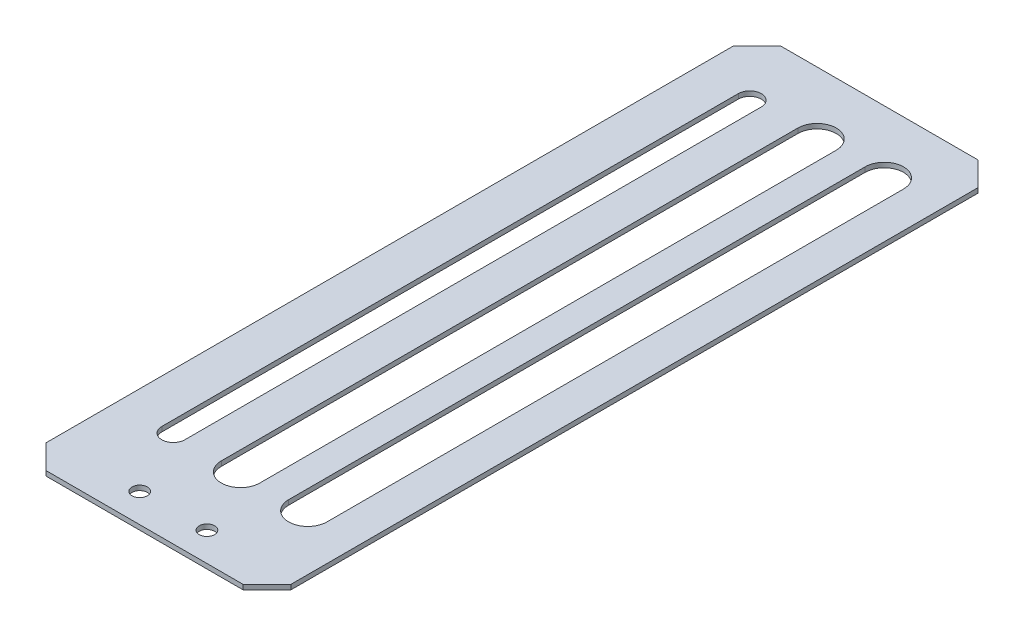
ISO-10303-21;
HEADER;
FILE_DESCRIPTION(('STEP AP214'),'2;1');
FILE_NAME('part.step','',(''),(''),'','','');
FILE_SCHEMA(('AUTOMOTIVE_DESIGN { 1 0 10303 214 1 1 1 1 }'));
ENDSEC;
DATA;
#1=APPLICATION_CONTEXT('core data for automotive mechanical design processes');
#2=APPLICATION_PROTOCOL_DEFINITION('international standard','automotive_design',2000,#1);
#3=PRODUCT_CONTEXT('',#1,'mechanical');
#4=PRODUCT('Part','Part','',(#3));
#5=PRODUCT_RELATED_PRODUCT_CATEGORY('part','',(#4));
#6=PRODUCT_DEFINITION_FORMATION('','',#4);
#7=PRODUCT_DEFINITION_CONTEXT('part definition',#1,'design');
#8=PRODUCT_DEFINITION('design','',#6,#7);
#9=PRODUCT_DEFINITION_SHAPE('','',#8);
#10=(LENGTH_UNIT() NAMED_UNIT(*) SI_UNIT(.MILLI.,.METRE.));
#11=(NAMED_UNIT(*) PLANE_ANGLE_UNIT() SI_UNIT($,.RADIAN.));
#12=(NAMED_UNIT(*) SI_UNIT($,.STERADIAN.) SOLID_ANGLE_UNIT());
#13=UNCERTAINTY_MEASURE_WITH_UNIT(LENGTH_MEASURE(1.E-05),#10,'distance_accuracy_value','');
#14=(GEOMETRIC_REPRESENTATION_CONTEXT(3) GLOBAL_UNCERTAINTY_ASSIGNED_CONTEXT((#13)) GLOBAL_UNIT_ASSIGNED_CONTEXT((#10,
#11,#12)) REPRESENTATION_CONTEXT('',''));
#15=CARTESIAN_POINT('',(0.,0.,0.));
#16=DIRECTION('',(0.,0.,1.));
#17=DIRECTION('',(1.,0.,0.));
#18=AXIS2_PLACEMENT_3D('',#15,#16,#17);
#19=CARTESIAN_POINT('',(-25.5,1.,-76.5));
#20=DIRECTION('',(1.,0.,0.));
#21=DIRECTION('',(0.,0.,-1.));
#22=AXIS2_PLACEMENT_3D('',#19,#20,#21);
#23=PLANE('',#22);
#24=DIRECTION('',(0.,0.,1.));
#25=VECTOR('',#24,1.);
#26=CARTESIAN_POINT('',(-25.5,1.,-76.5));
#27=LINE('',#26,#25);
#28=CARTESIAN_POINT('',(-25.5,1.,-71.5));
#29=VERTEX_POINT('',#28);
#30=CARTESIAN_POINT('',(-25.5,1.,71.5));
#31=VERTEX_POINT('',#30);
#32=EDGE_CURVE('E294',#29,#31,#27,.T.);
#33=ORIENTED_EDGE('',*,*,#32,.F.);
#34=DIRECTION('',(0.,-1.,0.));
#35=VECTOR('',#34,1.);
#36=CARTESIAN_POINT('',(-25.5,1.,-71.5));
#37=LINE('',#36,#35);
#38=CARTESIAN_POINT('',(-25.5,0.,-71.5));
#39=VERTEX_POINT('',#38);
#40=EDGE_CURVE('E316',#29,#39,#37,.T.);
#41=ORIENTED_EDGE('',*,*,#40,.T.);
#42=DIRECTION('',(0.,0.,1.));
#43=VECTOR('',#42,1.);
#44=CARTESIAN_POINT('',(-25.5,0.,-76.5));
#45=LINE('',#44,#43);
#46=CARTESIAN_POINT('',(-25.5,0.,71.5));
#47=VERTEX_POINT('',#46);
#48=EDGE_CURVE('E291',#39,#47,#45,.T.);
#49=ORIENTED_EDGE('',*,*,#48,.T.);
#50=DIRECTION('',(0.,1.,0.));
#51=VECTOR('',#50,1.);
#52=CARTESIAN_POINT('',(-25.5,1.,71.5));
#53=LINE('',#52,#51);
#54=EDGE_CURVE('E305',#47,#31,#53,.T.);
#55=ORIENTED_EDGE('',*,*,#54,.T.);
#56=EDGE_LOOP('',(#33,#41,#49,#55));
#57=FACE_BOUND('',#56,.T.);
#58=ADVANCED_FACE('F36',(#57),#23,.F.);
#59=CARTESIAN_POINT('',(25.5,1.,76.5));
#60=DIRECTION('',(0.,0.,-1.));
#61=DIRECTION('',(-1.,0.,0.));
#62=AXIS2_PLACEMENT_3D('',#59,#60,#61);
#63=PLANE('',#62);
#64=DIRECTION('',(1.,0.,0.));
#65=VECTOR('',#64,1.);
#66=CARTESIAN_POINT('',(25.5,0.,76.5));
#67=LINE('',#66,#65);
#68=CARTESIAN_POINT('',(-20.5,0.,76.5));
#69=VERTEX_POINT('',#68);
#70=CARTESIAN_POINT('',(20.5,0.,76.5));
#71=VERTEX_POINT('',#70);
#72=EDGE_CURVE('E308',#69,#71,#67,.T.);
#73=ORIENTED_EDGE('',*,*,#72,.T.);
#74=DIRECTION('',(0.,1.,0.));
#75=VECTOR('',#74,1.);
#76=CARTESIAN_POINT('',(20.5,1.,76.5));
#77=LINE('',#76,#75);
#78=CARTESIAN_POINT('',(20.5,1.,76.5));
#79=VERTEX_POINT('',#78);
#80=EDGE_CURVE('E11',#71,#79,#77,.T.);
#81=ORIENTED_EDGE('',*,*,#80,.T.);
#82=DIRECTION('',(1.,0.,0.));
#83=VECTOR('',#82,1.);
#84=CARTESIAN_POINT('',(25.5,1.,76.5));
#85=LINE('',#84,#83);
#86=CARTESIAN_POINT('',(-20.5,1.,76.5));
#87=VERTEX_POINT('',#86);
#88=EDGE_CURVE('E297',#87,#79,#85,.T.);
#89=ORIENTED_EDGE('',*,*,#88,.F.);
#90=DIRECTION('',(0.,-1.,0.));
#91=VECTOR('',#90,1.);
#92=CARTESIAN_POINT('',(-20.5,1.,76.5));
#93=LINE('',#92,#91);
#94=EDGE_CURVE('E45',#87,#69,#93,.T.);
#95=ORIENTED_EDGE('',*,*,#94,.T.);
#96=EDGE_LOOP('',(#73,#81,#89,#95));
#97=FACE_BOUND('',#96,.T.);
#98=ADVANCED_FACE('F347',(#97),#63,.F.);
#99=CARTESIAN_POINT('',(25.5,1.,-76.5));
#100=DIRECTION('',(-1.,0.,0.));
#101=DIRECTION('',(0.,0.,1.));
#102=AXIS2_PLACEMENT_3D('',#99,#100,#101);
#103=PLANE('',#102);
#104=DIRECTION('',(0.,0.,-1.));
#105=VECTOR('',#104,1.);
#106=CARTESIAN_POINT('',(25.5,0.,-76.5));
#107=LINE('',#106,#105);
#108=CARTESIAN_POINT('',(25.5,0.,71.5));
#109=VERTEX_POINT('',#108);
#110=CARTESIAN_POINT('',(25.5,0.,-71.5));
#111=VERTEX_POINT('',#110);
#112=EDGE_CURVE('E311',#109,#111,#107,.T.);
#113=ORIENTED_EDGE('',*,*,#112,.T.);
#114=DIRECTION('',(0.,1.,0.));
#115=VECTOR('',#114,1.);
#116=CARTESIAN_POINT('',(25.5,1.,-71.5));
#117=LINE('',#116,#115);
#118=CARTESIAN_POINT('',(25.5,1.,-71.5));
#119=VERTEX_POINT('',#118);
#120=EDGE_CURVE('E52',#111,#119,#117,.T.);
#121=ORIENTED_EDGE('',*,*,#120,.T.);
#122=DIRECTION('',(0.,0.,-1.));
#123=VECTOR('',#122,1.);
#124=CARTESIAN_POINT('',(25.5,1.,-76.5));
#125=LINE('',#124,#123);
#126=CARTESIAN_POINT('',(25.5,1.,71.5));
#127=VERTEX_POINT('',#126);
#128=EDGE_CURVE('E300',#127,#119,#125,.T.);
#129=ORIENTED_EDGE('',*,*,#128,.F.);
#130=DIRECTION('',(0.,-1.,0.));
#131=VECTOR('',#130,1.);
#132=CARTESIAN_POINT('',(25.5,1.,71.5));
#133=LINE('',#132,#131);
#134=EDGE_CURVE('E339',#127,#109,#133,.T.);
#135=ORIENTED_EDGE('',*,*,#134,.T.);
#136=EDGE_LOOP('',(#113,#121,#129,#135));
#137=FACE_BOUND('',#136,.T.);
#138=ADVANCED_FACE('F357',(#137),#103,.F.);
#139=CARTESIAN_POINT('',(25.5,1.,-76.5));
#140=DIRECTION('',(0.,0.,1.));
#141=DIRECTION('',(1.,0.,0.));
#142=AXIS2_PLACEMENT_3D('',#139,#140,#141);
#143=PLANE('',#142);
#144=DIRECTION('',(-1.,0.,0.));
#145=VECTOR('',#144,1.);
#146=CARTESIAN_POINT('',(25.5,0.,-76.5));
#147=LINE('',#146,#145);
#148=CARTESIAN_POINT('',(20.5,0.,-76.5));
#149=VERTEX_POINT('',#148);
#150=CARTESIAN_POINT('',(-20.5,0.,-76.5));
#151=VERTEX_POINT('',#150);
#152=EDGE_CURVE('E298',#149,#151,#147,.T.);
#153=ORIENTED_EDGE('',*,*,#152,.T.);
#154=DIRECTION('',(0.,1.,0.));
#155=VECTOR('',#154,1.);
#156=CARTESIAN_POINT('',(-20.5,1.,-76.5));
#157=LINE('',#156,#155);
#158=CARTESIAN_POINT('',(-20.5,1.,-76.5));
#159=VERTEX_POINT('',#158);
#160=EDGE_CURVE('E330',#151,#159,#157,.T.);
#161=ORIENTED_EDGE('',*,*,#160,.T.);
#162=DIRECTION('',(-1.,0.,0.));
#163=VECTOR('',#162,1.);
#164=CARTESIAN_POINT('',(25.5,1.,-76.5));
#165=LINE('',#164,#163);
#166=CARTESIAN_POINT('',(20.5,1.,-76.5));
#167=VERTEX_POINT('',#166);
#168=EDGE_CURVE('E302',#167,#159,#165,.T.);
#169=ORIENTED_EDGE('',*,*,#168,.F.);
#170=DIRECTION('',(0.,-1.,0.));
#171=VECTOR('',#170,1.);
#172=CARTESIAN_POINT('',(20.5,1.,-76.5));
#173=LINE('',#172,#171);
#174=EDGE_CURVE('E327',#167,#149,#173,.T.);
#175=ORIENTED_EDGE('',*,*,#174,.T.);
#176=EDGE_LOOP('',(#153,#161,#169,#175));
#177=FACE_BOUND('',#176,.T.);
#178=ADVANCED_FACE('F367',(#177),#143,.F.);
#179=CARTESIAN_POINT('',(0.,1.,0.));
#180=DIRECTION('',(0.,-1.,0.));
#181=DIRECTION('',(0.,0.,-1.));
#182=AXIS2_PLACEMENT_3D('',#179,#180,#181);
#183=PLANE('',#182);
#184=CARTESIAN_POINT('',(7.,1.,70.5));
#185=DIRECTION('',(0.,1.,0.));
#186=DIRECTION('',(0.,0.,1.));
#187=AXIS2_PLACEMENT_3D('',#184,#185,#186);
#188=CIRCLE('',#187,1.6);
#189=CARTESIAN_POINT('',(7.,1.,72.1));
#190=VERTEX_POINT('',#189);
#191=EDGE_CURVE('E245',#190,#190,#188,.T.);
#192=ORIENTED_EDGE('',*,*,#191,.F.);
#193=EDGE_LOOP('',(#192));
#194=FACE_BOUND('',#193,.T.);
#195=DIRECTION('',(0.,0.,1.));
#196=VECTOR('',#195,1.);
#197=CARTESIAN_POINT('',(-3.99999999999999,1.,-63.5));
#198=LINE('',#197,#196);
#199=CARTESIAN_POINT('',(-3.99999999999999,1.,-63.5));
#200=VERTEX_POINT('',#199);
#201=CARTESIAN_POINT('',(-4.00000000000001,1.,56.5));
#202=VERTEX_POINT('',#201);
#203=EDGE_CURVE('E234',#200,#202,#198,.T.);
#204=ORIENTED_EDGE('',*,*,#203,.F.);
#205=CARTESIAN_POINT('',(0.,1.,-63.5));
#206=DIRECTION('',(0.,1.,0.));
#207=DIRECTION('',(0.,0.,1.));
#208=AXIS2_PLACEMENT_3D('',#205,#206,#207);
#209=CIRCLE('',#208,3.99999999999999);
#210=CARTESIAN_POINT('',(3.99999999999999,1.,-63.5));
#211=VERTEX_POINT('',#210);
#212=EDGE_CURVE('E232',#211,#200,#209,.T.);
#213=ORIENTED_EDGE('',*,*,#212,.F.);
#214=DIRECTION('',(0.,0.,-1.));
#215=VECTOR('',#214,1.);
#216=CARTESIAN_POINT('',(3.99999999999999,1.,-63.5));
#217=LINE('',#216,#215);
#218=CARTESIAN_POINT('',(4.00000000000002,1.,56.5));
#219=VERTEX_POINT('',#218);
#220=EDGE_CURVE('E222',#219,#211,#217,.T.);
#221=ORIENTED_EDGE('',*,*,#220,.F.);
#222=CARTESIAN_POINT('',(0.,1.,56.5));
#223=DIRECTION('',(0.,1.,0.));
#224=DIRECTION('',(0.,0.,1.));
#225=AXIS2_PLACEMENT_3D('',#222,#223,#224);
#226=CIRCLE('',#225,4.00000000000001);
#227=EDGE_CURVE('E238',#202,#219,#226,.T.);
#228=ORIENTED_EDGE('',*,*,#227,.F.);
#229=EDGE_LOOP('',(#204,#213,#221,#228));
#230=FACE_BOUND('',#229,.T.);
#231=DIRECTION('',(0.,0.,1.));
#232=VECTOR('',#231,1.);
#233=CARTESIAN_POINT('',(10.,1.,-63.5));
#234=LINE('',#233,#232);
#235=CARTESIAN_POINT('',(10.,1.,-63.5));
#236=VERTEX_POINT('',#235);
#237=CARTESIAN_POINT('',(10.,1.,56.5));
#238=VERTEX_POINT('',#237);
#239=EDGE_CURVE('E267',#236,#238,#234,.T.);
#240=ORIENTED_EDGE('',*,*,#239,.F.);
#241=CARTESIAN_POINT('',(14.,1.,-63.5));
#242=DIRECTION('',(0.,1.,0.));
#243=DIRECTION('',(0.,0.,1.));
#244=AXIS2_PLACEMENT_3D('',#241,#242,#243);
#245=CIRCLE('',#244,4.);
#246=CARTESIAN_POINT('',(18.,1.,-63.5));
#247=VERTEX_POINT('',#246);
#248=EDGE_CURVE('E214',#247,#236,#245,.T.);
#249=ORIENTED_EDGE('',*,*,#248,.F.);
#250=DIRECTION('',(0.,0.,-1.));
#251=VECTOR('',#250,1.);
#252=CARTESIAN_POINT('',(18.,1.,-63.5));
#253=LINE('',#252,#251);
#254=CARTESIAN_POINT('',(18.,1.,56.5));
#255=VERTEX_POINT('',#254);
#256=EDGE_CURVE('E256',#255,#247,#253,.T.);
#257=ORIENTED_EDGE('',*,*,#256,.F.);
#258=CARTESIAN_POINT('',(14.,1.,56.5));
#259=DIRECTION('',(0.,1.,0.));
#260=DIRECTION('',(0.,0.,1.));
#261=AXIS2_PLACEMENT_3D('',#258,#259,#260);
#262=CIRCLE('',#261,4.);
#263=EDGE_CURVE('E270',#238,#255,#262,.T.);
#264=ORIENTED_EDGE('',*,*,#263,.F.);
#265=EDGE_LOOP('',(#240,#249,#257,#264));
#266=FACE_BOUND('',#265,.T.);
#267=CARTESIAN_POINT('',(-7.,1.,70.5));
#268=DIRECTION('',(0.,1.,0.));
#269=DIRECTION('',(0.,0.,1.));
#270=AXIS2_PLACEMENT_3D('',#267,#268,#269);
#271=CIRCLE('',#270,1.60000000000001);
#272=CARTESIAN_POINT('',(-7.,1.,72.1));
#273=VERTEX_POINT('',#272);
#274=EDGE_CURVE('E285',#273,#273,#271,.T.);
#275=ORIENTED_EDGE('',*,*,#274,.F.);
#276=EDGE_LOOP('',(#275));
#277=FACE_BOUND('',#276,.T.);
#278=ORIENTED_EDGE('',*,*,#168,.T.);
#279=DIRECTION('',(0.707106781186549,0.,-0.707106781186546));
#280=VECTOR('',#279,1.);
#281=CARTESIAN_POINT('',(-25.5,1.,-71.5));
#282=LINE('',#281,#280);
#283=EDGE_CURVE('E337',#159,#29,#282,.F.);
#284=ORIENTED_EDGE('',*,*,#283,.T.);
#285=ORIENTED_EDGE('',*,*,#32,.T.);
#286=DIRECTION('',(-0.707106781186547,0.,-0.707106781186548));
#287=VECTOR('',#286,1.);
#288=CARTESIAN_POINT('',(-20.5,1.,76.5));
#289=LINE('',#288,#287);
#290=EDGE_CURVE('E332',#31,#87,#289,.F.);
#291=ORIENTED_EDGE('',*,*,#290,.T.);
#292=ORIENTED_EDGE('',*,*,#88,.T.);
#293=DIRECTION('',(-0.707106781186549,0.,0.707106781186546));
#294=VECTOR('',#293,1.);
#295=CARTESIAN_POINT('',(25.5,1.,71.5));
#296=LINE('',#295,#294);
#297=EDGE_CURVE('E59',#79,#127,#296,.F.);
#298=ORIENTED_EDGE('',*,*,#297,.T.);
#299=ORIENTED_EDGE('',*,*,#128,.T.);
#300=DIRECTION('',(0.707106781186547,0.,0.707106781186549));
#301=VECTOR('',#300,1.);
#302=CARTESIAN_POINT('',(20.5,1.,-76.5));
#303=LINE('',#302,#301);
#304=EDGE_CURVE('E335',#119,#167,#303,.F.);
#305=ORIENTED_EDGE('',*,*,#304,.T.);
#306=EDGE_LOOP('',(#278,#284,#285,#291,#292,#298,#299,#305));
#307=FACE_BOUND('',#306,.T.);
#308=CARTESIAN_POINT('',(-14.,1.,-63.5));
#309=DIRECTION('',(0.,1.,0.));
#310=DIRECTION('',(0.,0.,1.));
#311=AXIS2_PLACEMENT_3D('',#308,#309,#310);
#312=CIRCLE('',#311,2.4);
#313=CARTESIAN_POINT('',(-11.6,1.,-63.5));
#314=VERTEX_POINT('',#313);
#315=CARTESIAN_POINT('',(-16.4,1.,-63.5));
#316=VERTEX_POINT('',#315);
#317=EDGE_CURVE('E182',#314,#316,#312,.T.);
#318=ORIENTED_EDGE('',*,*,#317,.F.);
#319=DIRECTION('',(0.,0.,-1.));
#320=VECTOR('',#319,1.);
#321=CARTESIAN_POINT('',(-11.6,1.,-63.5));
#322=LINE('',#321,#320);
#323=CARTESIAN_POINT('',(-11.6,1.,56.5));
#324=VERTEX_POINT('',#323);
#325=EDGE_CURVE('E199',#324,#314,#322,.T.);
#326=ORIENTED_EDGE('',*,*,#325,.F.);
#327=CARTESIAN_POINT('',(-14.,1.,56.5));
#328=DIRECTION('',(0.,1.,0.));
#329=DIRECTION('',(0.,0.,1.));
#330=AXIS2_PLACEMENT_3D('',#327,#328,#329);
#331=CIRCLE('',#330,2.4);
#332=CARTESIAN_POINT('',(-16.4,1.,56.5));
#333=VERTEX_POINT('',#332);
#334=EDGE_CURVE('E202',#333,#324,#331,.T.);
#335=ORIENTED_EDGE('',*,*,#334,.F.);
#336=DIRECTION('',(0.,0.,1.));
#337=VECTOR('',#336,1.);
#338=CARTESIAN_POINT('',(-16.4,1.,-63.5));
#339=LINE('',#338,#337);
#340=EDGE_CURVE('E208',#316,#333,#339,.T.);
#341=ORIENTED_EDGE('',*,*,#340,.F.);
#342=EDGE_LOOP('',(#318,#326,#335,#341));
#343=FACE_BOUND('',#342,.T.);
#344=ADVANCED_FACE('F359',(#194,#230,#266,#277,#307,#343),#183,.F.);
#345=CARTESIAN_POINT('',(0.,0.,0.));
#346=DIRECTION('',(0.,-1.,0.));
#347=DIRECTION('',(0.,0.,-1.));
#348=AXIS2_PLACEMENT_3D('',#345,#346,#347);
#349=PLANE('',#348);
#350=CARTESIAN_POINT('',(7.,0.,70.5));
#351=DIRECTION('',(0.,1.,0.));
#352=DIRECTION('',(0.,0.,1.));
#353=AXIS2_PLACEMENT_3D('',#350,#351,#352);
#354=CIRCLE('',#353,1.6);
#355=CARTESIAN_POINT('',(7.,0.,72.1));
#356=VERTEX_POINT('',#355);
#357=EDGE_CURVE('E282',#356,#356,#354,.T.);
#358=ORIENTED_EDGE('',*,*,#357,.T.);
#359=EDGE_LOOP('',(#358));
#360=FACE_BOUND('',#359,.T.);
#361=CARTESIAN_POINT('',(0.,0.,-63.5));
#362=DIRECTION('',(0.,1.,0.));
#363=DIRECTION('',(0.,0.,1.));
#364=AXIS2_PLACEMENT_3D('',#361,#362,#363);
#365=CIRCLE('',#364,3.99999999999999);
#366=CARTESIAN_POINT('',(3.99999999999999,0.,-63.5));
#367=VERTEX_POINT('',#366);
#368=CARTESIAN_POINT('',(-3.99999999999999,0.,-63.5));
#369=VERTEX_POINT('',#368);
#370=EDGE_CURVE('E218',#367,#369,#365,.T.);
#371=ORIENTED_EDGE('',*,*,#370,.T.);
#372=DIRECTION('',(0.,0.,1.));
#373=VECTOR('',#372,1.);
#374=CARTESIAN_POINT('',(-3.99999999999999,0.,-63.5));
#375=LINE('',#374,#373);
#376=CARTESIAN_POINT('',(-4.,0.,56.5));
#377=VERTEX_POINT('',#376);
#378=EDGE_CURVE('E221',#369,#377,#375,.T.);
#379=ORIENTED_EDGE('',*,*,#378,.T.);
#380=CARTESIAN_POINT('',(0.,0.,56.5));
#381=DIRECTION('',(0.,1.,0.));
#382=DIRECTION('',(0.,0.,1.));
#383=AXIS2_PLACEMENT_3D('',#380,#381,#382);
#384=CIRCLE('',#383,4.00000000000001);
#385=CARTESIAN_POINT('',(4.00000000000002,0.,56.5));
#386=VERTEX_POINT('',#385);
#387=EDGE_CURVE('E225',#377,#386,#384,.T.);
#388=ORIENTED_EDGE('',*,*,#387,.T.);
#389=DIRECTION('',(0.,0.,-1.));
#390=VECTOR('',#389,1.);
#391=CARTESIAN_POINT('',(3.99999999999999,0.,-63.5));
#392=LINE('',#391,#390);
#393=EDGE_CURVE('E228',#386,#367,#392,.T.);
#394=ORIENTED_EDGE('',*,*,#393,.T.);
#395=EDGE_LOOP('',(#371,#379,#388,#394));
#396=FACE_BOUND('',#395,.T.);
#397=CARTESIAN_POINT('',(14.,0.,-63.5));
#398=DIRECTION('',(0.,1.,0.));
#399=DIRECTION('',(0.,0.,1.));
#400=AXIS2_PLACEMENT_3D('',#397,#398,#399);
#401=CIRCLE('',#400,4.);
#402=CARTESIAN_POINT('',(18.,0.,-63.5));
#403=VERTEX_POINT('',#402);
#404=CARTESIAN_POINT('',(10.,0.,-63.5));
#405=VERTEX_POINT('',#404);
#406=EDGE_CURVE('E252',#403,#405,#401,.T.);
#407=ORIENTED_EDGE('',*,*,#406,.T.);
#408=DIRECTION('',(0.,0.,1.));
#409=VECTOR('',#408,1.);
#410=CARTESIAN_POINT('',(10.,0.,-63.5));
#411=LINE('',#410,#409);
#412=CARTESIAN_POINT('',(10.,0.,56.5));
#413=VERTEX_POINT('',#412);
#414=EDGE_CURVE('E255',#405,#413,#411,.T.);
#415=ORIENTED_EDGE('',*,*,#414,.T.);
#416=CARTESIAN_POINT('',(14.,0.,56.5));
#417=DIRECTION('',(0.,1.,0.));
#418=DIRECTION('',(0.,0.,1.));
#419=AXIS2_PLACEMENT_3D('',#416,#417,#418);
#420=CIRCLE('',#419,4.);
#421=CARTESIAN_POINT('',(18.,0.,56.5));
#422=VERTEX_POINT('',#421);
#423=EDGE_CURVE('E259',#413,#422,#420,.T.);
#424=ORIENTED_EDGE('',*,*,#423,.T.);
#425=DIRECTION('',(0.,0.,-1.));
#426=VECTOR('',#425,1.);
#427=CARTESIAN_POINT('',(18.,0.,-63.5));
#428=LINE('',#427,#426);
#429=EDGE_CURVE('E262',#422,#403,#428,.T.);
#430=ORIENTED_EDGE('',*,*,#429,.T.);
#431=EDGE_LOOP('',(#407,#415,#424,#430));
#432=FACE_BOUND('',#431,.T.);
#433=CARTESIAN_POINT('',(-7.,0.,70.5));
#434=DIRECTION('',(0.,1.,0.));
#435=DIRECTION('',(0.,0.,1.));
#436=AXIS2_PLACEMENT_3D('',#433,#434,#435);
#437=CIRCLE('',#436,1.60000000000001);
#438=CARTESIAN_POINT('',(-7.,0.,72.1));
#439=VERTEX_POINT('',#438);
#440=EDGE_CURVE('E288',#439,#439,#437,.T.);
#441=ORIENTED_EDGE('',*,*,#440,.T.);
#442=EDGE_LOOP('',(#441));
#443=FACE_BOUND('',#442,.T.);
#444=ORIENTED_EDGE('',*,*,#48,.F.);
#445=DIRECTION('',(-0.707106781186549,0.,0.707106781186546));
#446=VECTOR('',#445,1.);
#447=CARTESIAN_POINT('',(-48.5,0.,-48.5000000000001));
#448=LINE('',#447,#446);
#449=EDGE_CURVE('E325',#39,#151,#448,.F.);
#450=ORIENTED_EDGE('',*,*,#449,.T.);
#451=ORIENTED_EDGE('',*,*,#152,.F.);
#452=DIRECTION('',(-0.707106781186547,0.,-0.707106781186549));
#453=VECTOR('',#452,1.);
#454=CARTESIAN_POINT('',(48.5,0.,-48.4999999999999));
#455=LINE('',#454,#453);
#456=EDGE_CURVE('E323',#149,#111,#455,.F.);
#457=ORIENTED_EDGE('',*,*,#456,.T.);
#458=ORIENTED_EDGE('',*,*,#112,.F.);
#459=DIRECTION('',(0.707106781186549,0.,-0.707106781186546));
#460=VECTOR('',#459,1.);
#461=CARTESIAN_POINT('',(48.4999999999999,0.,48.5000000000002));
#462=LINE('',#461,#460);
#463=EDGE_CURVE('E321',#109,#71,#462,.F.);
#464=ORIENTED_EDGE('',*,*,#463,.T.);
#465=ORIENTED_EDGE('',*,*,#72,.F.);
#466=DIRECTION('',(0.707106781186547,0.,0.707106781186548));
#467=VECTOR('',#466,1.);
#468=CARTESIAN_POINT('',(-48.5,0.,48.5));
#469=LINE('',#468,#467);
#470=EDGE_CURVE('E319',#69,#47,#469,.F.);
#471=ORIENTED_EDGE('',*,*,#470,.T.);
#472=EDGE_LOOP('',(#444,#450,#451,#457,#458,#464,#465,#471));
#473=FACE_BOUND('',#472,.T.);
#474=DIRECTION('',(0.,0.,-1.));
#475=VECTOR('',#474,1.);
#476=CARTESIAN_POINT('',(-11.6,0.,-63.5));
#477=LINE('',#476,#475);
#478=CARTESIAN_POINT('',(-11.6,0.,56.5));
#479=VERTEX_POINT('',#478);
#480=CARTESIAN_POINT('',(-11.6,0.,-63.5));
#481=VERTEX_POINT('',#480);
#482=EDGE_CURVE('E187',#479,#481,#477,.T.);
#483=ORIENTED_EDGE('',*,*,#482,.T.);
#484=CARTESIAN_POINT('',(-14.,0.,-63.5));
#485=DIRECTION('',(0.,1.,0.));
#486=DIRECTION('',(0.,0.,1.));
#487=AXIS2_PLACEMENT_3D('',#484,#485,#486);
#488=CIRCLE('',#487,2.4);
#489=CARTESIAN_POINT('',(-16.4,0.,-63.5));
#490=VERTEX_POINT('',#489);
#491=EDGE_CURVE('E179',#481,#490,#488,.T.);
#492=ORIENTED_EDGE('',*,*,#491,.T.);
#493=DIRECTION('',(0.,0.,1.));
#494=VECTOR('',#493,1.);
#495=CARTESIAN_POINT('',(-16.4,0.,-63.5));
#496=LINE('',#495,#494);
#497=CARTESIAN_POINT('',(-16.4,0.,56.5));
#498=VERTEX_POINT('',#497);
#499=EDGE_CURVE('E191',#490,#498,#496,.T.);
#500=ORIENTED_EDGE('',*,*,#499,.T.);
#501=CARTESIAN_POINT('',(-14.,0.,56.5));
#502=DIRECTION('',(0.,1.,0.));
#503=DIRECTION('',(0.,0.,1.));
#504=AXIS2_PLACEMENT_3D('',#501,#502,#503);
#505=CIRCLE('',#504,2.4);
#506=EDGE_CURVE('E195',#498,#479,#505,.T.);
#507=ORIENTED_EDGE('',*,*,#506,.T.);
#508=EDGE_LOOP('',(#483,#492,#500,#507));
#509=FACE_BOUND('',#508,.T.);
#510=ADVANCED_FACE('F197',(#360,#396,#432,#443,#473,#509),#349,.T.);
#511=CARTESIAN_POINT('',(-7.,0.,70.5));
#512=DIRECTION('',(0.,1.,0.));
#513=DIRECTION('',(0.,0.,1.));
#514=AXIS2_PLACEMENT_3D('',#511,#512,#513);
#515=CYLINDRICAL_SURFACE('',#514,1.60000000000001);
#516=ORIENTED_EDGE('',*,*,#440,.F.);
#517=EDGE_LOOP('',(#516));
#518=FACE_BOUND('',#517,.T.);
#519=ORIENTED_EDGE('',*,*,#274,.T.);
#520=EDGE_LOOP('',(#519));
#521=FACE_BOUND('',#520,.T.);
#522=ADVANCED_FACE('F439',(#518,#521),#515,.F.);
#523=CARTESIAN_POINT('',(14.,0.,-63.5));
#524=DIRECTION('',(0.,1.,0.));
#525=DIRECTION('',(0.,0.,1.));
#526=AXIS2_PLACEMENT_3D('',#523,#524,#525);
#527=CYLINDRICAL_SURFACE('',#526,4.);
#528=ORIENTED_EDGE('',*,*,#248,.T.);
#529=DIRECTION('',(0.,1.,0.));
#530=VECTOR('',#529,1.);
#531=CARTESIAN_POINT('',(10.,0.,-63.5));
#532=LINE('',#531,#530);
#533=EDGE_CURVE('E265',#405,#236,#532,.T.);
#534=ORIENTED_EDGE('',*,*,#533,.F.);
#535=ORIENTED_EDGE('',*,*,#406,.F.);
#536=DIRECTION('',(0.,1.,0.));
#537=VECTOR('',#536,1.);
#538=CARTESIAN_POINT('',(18.,0.,-63.5));
#539=LINE('',#538,#537);
#540=EDGE_CURVE('E235',#403,#247,#539,.T.);
#541=ORIENTED_EDGE('',*,*,#540,.T.);
#542=EDGE_LOOP('',(#528,#534,#535,#541));
#543=FACE_BOUND('',#542,.T.);
#544=ADVANCED_FACE('F501',(#543),#527,.F.);
#545=CARTESIAN_POINT('',(18.,0.,-63.5));
#546=DIRECTION('',(1.,0.,0.));
#547=DIRECTION('',(0.,0.,-1.));
#548=AXIS2_PLACEMENT_3D('',#545,#546,#547);
#549=PLANE('',#548);
#550=ORIENTED_EDGE('',*,*,#256,.T.);
#551=ORIENTED_EDGE('',*,*,#540,.F.);
#552=ORIENTED_EDGE('',*,*,#429,.F.);
#553=DIRECTION('',(0.,1.,0.));
#554=VECTOR('',#553,1.);
#555=CARTESIAN_POINT('',(18.,0.,56.5));
#556=LINE('',#555,#554);
#557=EDGE_CURVE('E276',#422,#255,#556,.T.);
#558=ORIENTED_EDGE('',*,*,#557,.T.);
#559=EDGE_LOOP('',(#550,#551,#552,#558));
#560=FACE_BOUND('',#559,.T.);
#561=ADVANCED_FACE('F497',(#560),#549,.F.);
#562=CARTESIAN_POINT('',(14.,0.,56.5));
#563=DIRECTION('',(0.,1.,0.));
#564=DIRECTION('',(0.,0.,1.));
#565=AXIS2_PLACEMENT_3D('',#562,#563,#564);
#566=CYLINDRICAL_SURFACE('',#565,4.);
#567=ORIENTED_EDGE('',*,*,#263,.T.);
#568=ORIENTED_EDGE('',*,*,#557,.F.);
#569=ORIENTED_EDGE('',*,*,#423,.F.);
#570=DIRECTION('',(0.,1.,0.));
#571=VECTOR('',#570,1.);
#572=CARTESIAN_POINT('',(10.,0.,56.5));
#573=LINE('',#572,#571);
#574=EDGE_CURVE('E278',#413,#238,#573,.T.);
#575=ORIENTED_EDGE('',*,*,#574,.T.);
#576=EDGE_LOOP('',(#567,#568,#569,#575));
#577=FACE_BOUND('',#576,.T.);
#578=ADVANCED_FACE('F500',(#577),#566,.F.);
#579=CARTESIAN_POINT('',(10.,0.,-63.5));
#580=DIRECTION('',(-1.,0.,0.));
#581=DIRECTION('',(0.,0.,1.));
#582=AXIS2_PLACEMENT_3D('',#579,#580,#581);
#583=PLANE('',#582);
#584=ORIENTED_EDGE('',*,*,#239,.T.);
#585=ORIENTED_EDGE('',*,*,#574,.F.);
#586=ORIENTED_EDGE('',*,*,#414,.F.);
#587=ORIENTED_EDGE('',*,*,#533,.T.);
#588=EDGE_LOOP('',(#584,#585,#586,#587));
#589=FACE_BOUND('',#588,.T.);
#590=ADVANCED_FACE('F495',(#589),#583,.F.);
#591=CARTESIAN_POINT('',(0.,0.,-63.5));
#592=DIRECTION('',(0.,1.,0.));
#593=DIRECTION('',(0.,0.,1.));
#594=AXIS2_PLACEMENT_3D('',#591,#592,#593);
#595=CYLINDRICAL_SURFACE('',#594,3.99999999999999);
#596=ORIENTED_EDGE('',*,*,#212,.T.);
#597=DIRECTION('',(0.,1.,0.));
#598=VECTOR('',#597,1.);
#599=CARTESIAN_POINT('',(-3.99999999999999,0.,-63.5));
#600=LINE('',#599,#598);
#601=EDGE_CURVE('E231',#369,#200,#600,.T.);
#602=ORIENTED_EDGE('',*,*,#601,.F.);
#603=ORIENTED_EDGE('',*,*,#370,.F.);
#604=DIRECTION('',(0.,1.,0.));
#605=VECTOR('',#604,1.);
#606=CARTESIAN_POINT('',(3.99999999999999,0.,-63.5));
#607=LINE('',#606,#605);
#608=EDGE_CURVE('E243',#367,#211,#607,.T.);
#609=ORIENTED_EDGE('',*,*,#608,.T.);
#610=EDGE_LOOP('',(#596,#602,#603,#609));
#611=FACE_BOUND('',#610,.T.);
#612=ADVANCED_FACE('F484',(#611),#595,.F.);
#613=CARTESIAN_POINT('',(3.99999999999999,0.,-63.5));
#614=DIRECTION('',(1.,0.,0.));
#615=DIRECTION('',(0.,0.,-1.));
#616=AXIS2_PLACEMENT_3D('',#613,#614,#615);
#617=PLANE('',#616);
#618=ORIENTED_EDGE('',*,*,#220,.T.);
#619=ORIENTED_EDGE('',*,*,#608,.F.);
#620=ORIENTED_EDGE('',*,*,#393,.F.);
#621=DIRECTION('',(0.,1.,0.));
#622=VECTOR('',#621,1.);
#623=CARTESIAN_POINT('',(4.00000000000002,0.,56.5));
#624=LINE('',#623,#622);
#625=EDGE_CURVE('E246',#386,#219,#624,.T.);
#626=ORIENTED_EDGE('',*,*,#625,.T.);
#627=EDGE_LOOP('',(#618,#619,#620,#626));
#628=FACE_BOUND('',#627,.T.);
#629=ADVANCED_FACE('F480',(#628),#617,.F.);
#630=CARTESIAN_POINT('',(0.,0.,56.5));
#631=DIRECTION('',(0.,1.,0.));
#632=DIRECTION('',(0.,0.,1.));
#633=AXIS2_PLACEMENT_3D('',#630,#631,#632);
#634=CYLINDRICAL_SURFACE('',#633,4.00000000000001);
#635=ORIENTED_EDGE('',*,*,#227,.T.);
#636=ORIENTED_EDGE('',*,*,#625,.F.);
#637=ORIENTED_EDGE('',*,*,#387,.F.);
#638=DIRECTION('',(0.,1.,0.));
#639=VECTOR('',#638,1.);
#640=CARTESIAN_POINT('',(-4.00000000000001,0.,56.5));
#641=LINE('',#640,#639);
#642=EDGE_CURVE('E248',#377,#202,#641,.T.);
#643=ORIENTED_EDGE('',*,*,#642,.T.);
#644=EDGE_LOOP('',(#635,#636,#637,#643));
#645=FACE_BOUND('',#644,.T.);
#646=ADVANCED_FACE('F483',(#645),#634,.F.);
#647=CARTESIAN_POINT('',(-3.99999999999999,0.,-63.5));
#648=DIRECTION('',(-1.,0.,0.));
#649=DIRECTION('',(0.,0.,1.));
#650=AXIS2_PLACEMENT_3D('',#647,#648,#649);
#651=PLANE('',#650);
#652=ORIENTED_EDGE('',*,*,#203,.T.);
#653=ORIENTED_EDGE('',*,*,#642,.F.);
#654=ORIENTED_EDGE('',*,*,#378,.F.);
#655=ORIENTED_EDGE('',*,*,#601,.T.);
#656=EDGE_LOOP('',(#652,#653,#654,#655));
#657=FACE_BOUND('',#656,.T.);
#658=ADVANCED_FACE('F488',(#657),#651,.F.);
#659=CARTESIAN_POINT('',(7.,0.,70.5));
#660=DIRECTION('',(0.,1.,0.));
#661=DIRECTION('',(0.,0.,1.));
#662=AXIS2_PLACEMENT_3D('',#659,#660,#661);
#663=CYLINDRICAL_SURFACE('',#662,1.6);
#664=ORIENTED_EDGE('',*,*,#357,.F.);
#665=EDGE_LOOP('',(#664));
#666=FACE_BOUND('',#665,.T.);
#667=ORIENTED_EDGE('',*,*,#191,.T.);
#668=EDGE_LOOP('',(#667));
#669=FACE_BOUND('',#668,.T.);
#670=ADVANCED_FACE('F397',(#666,#669),#663,.F.);
#671=CARTESIAN_POINT('',(-25.5,1.,-71.5));
#672=DIRECTION('',(0.707106781186546,0.,0.707106781186549));
#673=DIRECTION('',(0.,-1.,0.));
#674=AXIS2_PLACEMENT_3D('',#671,#672,#673);
#675=PLANE('',#674);
#676=ORIENTED_EDGE('',*,*,#283,.F.);
#677=ORIENTED_EDGE('',*,*,#160,.F.);
#678=ORIENTED_EDGE('',*,*,#449,.F.);
#679=ORIENTED_EDGE('',*,*,#40,.F.);
#680=EDGE_LOOP('',(#676,#677,#678,#679));
#681=FACE_BOUND('',#680,.T.);
#682=ADVANCED_FACE('F372',(#681),#675,.F.);
#683=CARTESIAN_POINT('',(20.5,1.,-76.5));
#684=DIRECTION('',(-0.707106781186548,0.,0.707106781186546));
#685=DIRECTION('',(0.,-1.,0.));
#686=AXIS2_PLACEMENT_3D('',#683,#684,#685);
#687=PLANE('',#686);
#688=ORIENTED_EDGE('',*,*,#304,.F.);
#689=ORIENTED_EDGE('',*,*,#120,.F.);
#690=ORIENTED_EDGE('',*,*,#456,.F.);
#691=ORIENTED_EDGE('',*,*,#174,.F.);
#692=EDGE_LOOP('',(#688,#689,#690,#691));
#693=FACE_BOUND('',#692,.T.);
#694=ADVANCED_FACE('F364',(#693),#687,.F.);
#695=CARTESIAN_POINT('',(25.5,1.,71.5));
#696=DIRECTION('',(-0.707106781186546,0.,-0.707106781186549));
#697=DIRECTION('',(0.,-1.,0.));
#698=AXIS2_PLACEMENT_3D('',#695,#696,#697);
#699=PLANE('',#698);
#700=ORIENTED_EDGE('',*,*,#297,.F.);
#701=ORIENTED_EDGE('',*,*,#80,.F.);
#702=ORIENTED_EDGE('',*,*,#463,.F.);
#703=ORIENTED_EDGE('',*,*,#134,.F.);
#704=EDGE_LOOP('',(#700,#701,#702,#703));
#705=FACE_BOUND('',#704,.T.);
#706=ADVANCED_FACE('F356',(#705),#699,.F.);
#707=CARTESIAN_POINT('',(-20.5,1.,76.5));
#708=DIRECTION('',(0.707106781186548,0.,-0.707106781186547));
#709=DIRECTION('',(0.,-1.,0.));
#710=AXIS2_PLACEMENT_3D('',#707,#708,#709);
#711=PLANE('',#710);
#712=ORIENTED_EDGE('',*,*,#290,.F.);
#713=ORIENTED_EDGE('',*,*,#54,.F.);
#714=ORIENTED_EDGE('',*,*,#470,.F.);
#715=ORIENTED_EDGE('',*,*,#94,.F.);
#716=EDGE_LOOP('',(#712,#713,#714,#715));
#717=FACE_BOUND('',#716,.T.);
#718=ADVANCED_FACE('F39',(#717),#711,.F.);
#719=CARTESIAN_POINT('',(-14.,0.,-63.5));
#720=DIRECTION('',(0.,1.,0.));
#721=DIRECTION('',(0.,0.,1.));
#722=AXIS2_PLACEMENT_3D('',#719,#720,#721);
#723=CYLINDRICAL_SURFACE('',#722,2.4);
#724=ORIENTED_EDGE('',*,*,#317,.T.);
#725=DIRECTION('',(0.,1.,0.));
#726=VECTOR('',#725,1.);
#727=CARTESIAN_POINT('',(-16.4,0.,-63.5));
#728=LINE('',#727,#726);
#729=EDGE_CURVE('E175',#490,#316,#728,.T.);
#730=ORIENTED_EDGE('',*,*,#729,.F.);
#731=ORIENTED_EDGE('',*,*,#491,.F.);
#732=DIRECTION('',(0.,1.,0.));
#733=VECTOR('',#732,1.);
#734=CARTESIAN_POINT('',(-11.6,0.,-63.5));
#735=LINE('',#734,#733);
#736=EDGE_CURVE('E212',#481,#314,#735,.T.);
#737=ORIENTED_EDGE('',*,*,#736,.T.);
#738=EDGE_LOOP('',(#724,#730,#731,#737));
#739=FACE_BOUND('',#738,.T.);
#740=ADVANCED_FACE('F177',(#739),#723,.F.);
#741=CARTESIAN_POINT('',(-11.6,0.,-63.5));
#742=DIRECTION('',(1.,0.,0.));
#743=DIRECTION('',(0.,0.,-1.));
#744=AXIS2_PLACEMENT_3D('',#741,#742,#743);
#745=PLANE('',#744);
#746=ORIENTED_EDGE('',*,*,#325,.T.);
#747=ORIENTED_EDGE('',*,*,#736,.F.);
#748=ORIENTED_EDGE('',*,*,#482,.F.);
#749=DIRECTION('',(0.,1.,0.));
#750=VECTOR('',#749,1.);
#751=CARTESIAN_POINT('',(-11.6,0.,56.5));
#752=LINE('',#751,#750);
#753=EDGE_CURVE('E215',#479,#324,#752,.T.);
#754=ORIENTED_EDGE('',*,*,#753,.T.);
#755=EDGE_LOOP('',(#746,#747,#748,#754));
#756=FACE_BOUND('',#755,.T.);
#757=ADVANCED_FACE('F381',(#756),#745,.F.);
#758=CARTESIAN_POINT('',(-14.,0.,56.5));
#759=DIRECTION('',(0.,1.,0.));
#760=DIRECTION('',(0.,0.,1.));
#761=AXIS2_PLACEMENT_3D('',#758,#759,#760);
#762=CYLINDRICAL_SURFACE('',#761,2.4);
#763=ORIENTED_EDGE('',*,*,#334,.T.);
#764=ORIENTED_EDGE('',*,*,#753,.F.);
#765=ORIENTED_EDGE('',*,*,#506,.F.);
#766=DIRECTION('',(0.,1.,0.));
#767=VECTOR('',#766,1.);
#768=CARTESIAN_POINT('',(-16.4,0.,56.5));
#769=LINE('',#768,#767);
#770=EDGE_CURVE('E186',#498,#333,#769,.T.);
#771=ORIENTED_EDGE('',*,*,#770,.T.);
#772=EDGE_LOOP('',(#763,#764,#765,#771));
#773=FACE_BOUND('',#772,.T.);
#774=ADVANCED_FACE('F457',(#773),#762,.F.);
#775=CARTESIAN_POINT('',(-16.4,0.,-63.5));
#776=DIRECTION('',(-1.,0.,0.));
#777=DIRECTION('',(0.,0.,1.));
#778=AXIS2_PLACEMENT_3D('',#775,#776,#777);
#779=PLANE('',#778);
#780=ORIENTED_EDGE('',*,*,#340,.T.);
#781=ORIENTED_EDGE('',*,*,#770,.F.);
#782=ORIENTED_EDGE('',*,*,#499,.F.);
#783=ORIENTED_EDGE('',*,*,#729,.T.);
#784=EDGE_LOOP('',(#780,#781,#782,#783));
#785=FACE_BOUND('',#784,.T.);
#786=ADVANCED_FACE('F192',(#785),#779,.F.);
#787=CLOSED_SHELL('',(#58,#98,#138,#178,#344,#510,#522,#544,#561,#578,#590,#612,#629,#646,#658,
#670,#682,#694,#706,#718,#740,#757,#774,#786));
#788=MANIFOLD_SOLID_BREP('B2',#787);
#789=ADVANCED_BREP_SHAPE_REPRESENTATION('',(#18,#788),#14);
#790=SHAPE_DEFINITION_REPRESENTATION(#9,#789);
ENDSEC;
END-ISO-10303-21;
